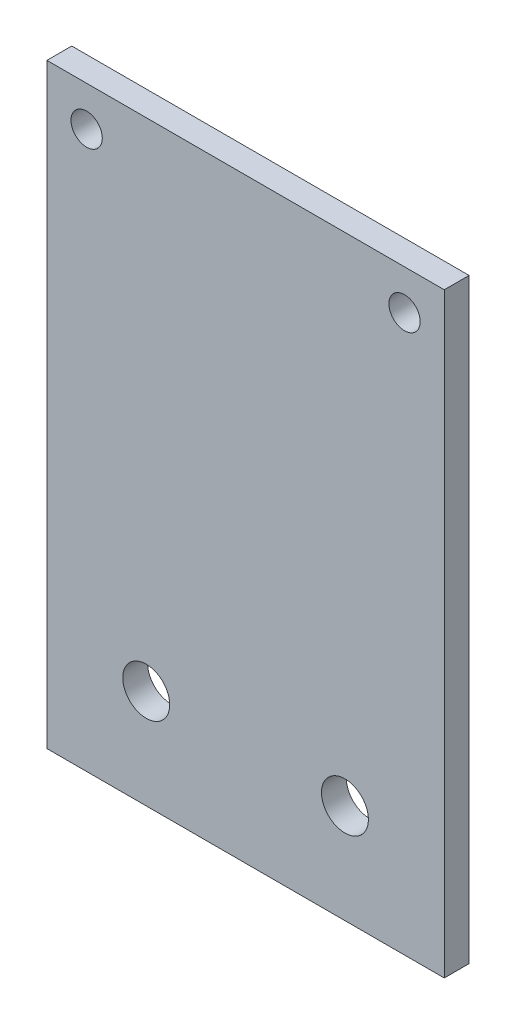
ISO-10303-21;
HEADER;
FILE_DESCRIPTION(('STEP AP214'),'2;1');
FILE_NAME('part.step','',(''),(''),'','','');
FILE_SCHEMA(('AUTOMOTIVE_DESIGN { 1 0 10303 214 1 1 1 1 }'));
ENDSEC;
DATA;
#1=APPLICATION_CONTEXT('core data for automotive mechanical design processes');
#2=APPLICATION_PROTOCOL_DEFINITION('international standard','automotive_design',2000,#1);
#3=PRODUCT_CONTEXT('',#1,'mechanical');
#4=PRODUCT('Part','Part','',(#3));
#5=PRODUCT_RELATED_PRODUCT_CATEGORY('part','',(#4));
#6=PRODUCT_DEFINITION_FORMATION('','',#4);
#7=PRODUCT_DEFINITION_CONTEXT('part definition',#1,'design');
#8=PRODUCT_DEFINITION('design','',#6,#7);
#9=PRODUCT_DEFINITION_SHAPE('','',#8);
#10=(LENGTH_UNIT() NAMED_UNIT(*) SI_UNIT(.MILLI.,.METRE.));
#11=(NAMED_UNIT(*) PLANE_ANGLE_UNIT() SI_UNIT($,.RADIAN.));
#12=(NAMED_UNIT(*) SI_UNIT($,.STERADIAN.) SOLID_ANGLE_UNIT());
#13=UNCERTAINTY_MEASURE_WITH_UNIT(LENGTH_MEASURE(1.E-05),#10,'distance_accuracy_value','');
#14=(GEOMETRIC_REPRESENTATION_CONTEXT(3) GLOBAL_UNCERTAINTY_ASSIGNED_CONTEXT((#13)) GLOBAL_UNIT_ASSIGNED_CONTEXT((#10,
#11,#12)) REPRESENTATION_CONTEXT('',''));
#15=CARTESIAN_POINT('',(0.,0.,0.));
#16=DIRECTION('',(0.,0.,1.));
#17=DIRECTION('',(1.,0.,0.));
#18=AXIS2_PLACEMENT_3D('',#15,#16,#17);
#19=CARTESIAN_POINT('',(0.,0.,3.175));
#20=DIRECTION('',(1.,0.,0.));
#21=DIRECTION('',(0.,1.,0.));
#22=AXIS2_PLACEMENT_3D('',#19,#20,#21);
#23=PLANE('',#22);
#24=DIRECTION('',(0.,-1.,0.));
#25=VECTOR('',#24,1.);
#26=CARTESIAN_POINT('',(0.,0.,0.));
#27=LINE('',#26,#25);
#28=CARTESIAN_POINT('',(0.,76.2,0.));
#29=VERTEX_POINT('',#28);
#30=CARTESIAN_POINT('',(0.,0.,0.));
#31=VERTEX_POINT('',#30);
#32=EDGE_CURVE('E94',#29,#31,#27,.T.);
#33=ORIENTED_EDGE('',*,*,#32,.T.);
#34=DIRECTION('',(0.,0.,-1.));
#35=VECTOR('',#34,1.);
#36=CARTESIAN_POINT('',(0.,0.,3.175));
#37=LINE('',#36,#35);
#38=CARTESIAN_POINT('',(0.,0.,3.175));
#39=VERTEX_POINT('',#38);
#40=EDGE_CURVE('E11',#39,#31,#37,.T.);
#41=ORIENTED_EDGE('',*,*,#40,.F.);
#42=DIRECTION('',(0.,-1.,0.));
#43=VECTOR('',#42,1.);
#44=CARTESIAN_POINT('',(0.,0.,3.175));
#45=LINE('',#44,#43);
#46=CARTESIAN_POINT('',(0.,76.2,3.175));
#47=VERTEX_POINT('',#46);
#48=EDGE_CURVE('E82',#47,#39,#45,.T.);
#49=ORIENTED_EDGE('',*,*,#48,.F.);
#50=DIRECTION('',(0.,0.,-1.));
#51=VECTOR('',#50,1.);
#52=CARTESIAN_POINT('',(0.,76.2,3.175));
#53=LINE('',#52,#51);
#54=EDGE_CURVE('E90',#47,#29,#53,.T.);
#55=ORIENTED_EDGE('',*,*,#54,.T.);
#56=EDGE_LOOP('',(#33,#41,#49,#55));
#57=FACE_BOUND('',#56,.T.);
#58=ADVANCED_FACE('F31',(#57),#23,.F.);
#59=CARTESIAN_POINT('',(0.,0.,3.175));
#60=DIRECTION('',(0.,1.,0.));
#61=DIRECTION('',(0.,0.,1.));
#62=AXIS2_PLACEMENT_3D('',#59,#60,#61);
#63=PLANE('',#62);
#64=DIRECTION('',(1.,0.,0.));
#65=VECTOR('',#64,1.);
#66=CARTESIAN_POINT('',(0.,0.,0.));
#67=LINE('',#66,#65);
#68=CARTESIAN_POINT('',(50.8,0.,0.));
#69=VERTEX_POINT('',#68);
#70=EDGE_CURVE('E86',#31,#69,#67,.T.);
#71=ORIENTED_EDGE('',*,*,#70,.T.);
#72=DIRECTION('',(0.,0.,-1.));
#73=VECTOR('',#72,1.);
#74=CARTESIAN_POINT('',(50.8,0.,3.175));
#75=LINE('',#74,#73);
#76=CARTESIAN_POINT('',(50.8,0.,3.175));
#77=VERTEX_POINT('',#76);
#78=EDGE_CURVE('E39',#77,#69,#75,.T.);
#79=ORIENTED_EDGE('',*,*,#78,.F.);
#80=DIRECTION('',(1.,0.,0.));
#81=VECTOR('',#80,1.);
#82=CARTESIAN_POINT('',(0.,0.,3.175));
#83=LINE('',#82,#81);
#84=EDGE_CURVE('E77',#39,#77,#83,.T.);
#85=ORIENTED_EDGE('',*,*,#84,.F.);
#86=ORIENTED_EDGE('',*,*,#40,.T.);
#87=EDGE_LOOP('',(#71,#79,#85,#86));
#88=FACE_BOUND('',#87,.T.);
#89=ADVANCED_FACE('F85',(#88),#63,.F.);
#90=CARTESIAN_POINT('',(50.8,0.,3.175));
#91=DIRECTION('',(-1.,0.,0.));
#92=DIRECTION('',(0.,-1.,0.));
#93=AXIS2_PLACEMENT_3D('',#90,#91,#92);
#94=PLANE('',#93);
#95=DIRECTION('',(0.,1.,0.));
#96=VECTOR('',#95,1.);
#97=CARTESIAN_POINT('',(50.8,0.,0.));
#98=LINE('',#97,#96);
#99=CARTESIAN_POINT('',(50.8,76.2,0.));
#100=VERTEX_POINT('',#99);
#101=EDGE_CURVE('E64',#69,#100,#98,.T.);
#102=ORIENTED_EDGE('',*,*,#101,.T.);
#103=DIRECTION('',(0.,0.,-1.));
#104=VECTOR('',#103,1.);
#105=CARTESIAN_POINT('',(50.8,76.2,3.175));
#106=LINE('',#105,#104);
#107=CARTESIAN_POINT('',(50.8,76.2,3.175));
#108=VERTEX_POINT('',#107);
#109=EDGE_CURVE('E87',#108,#100,#106,.T.);
#110=ORIENTED_EDGE('',*,*,#109,.F.);
#111=DIRECTION('',(0.,1.,0.));
#112=VECTOR('',#111,1.);
#113=CARTESIAN_POINT('',(50.8,0.,3.175));
#114=LINE('',#113,#112);
#115=EDGE_CURVE('E80',#77,#108,#114,.T.);
#116=ORIENTED_EDGE('',*,*,#115,.F.);
#117=ORIENTED_EDGE('',*,*,#78,.T.);
#118=EDGE_LOOP('',(#102,#110,#116,#117));
#119=FACE_BOUND('',#118,.T.);
#120=ADVANCED_FACE('F88',(#119),#94,.F.);
#121=CARTESIAN_POINT('',(0.,76.2,3.175));
#122=DIRECTION('',(0.,-1.,0.));
#123=DIRECTION('',(0.,0.,-1.));
#124=AXIS2_PLACEMENT_3D('',#121,#122,#123);
#125=PLANE('',#124);
#126=DIRECTION('',(-1.,0.,0.));
#127=VECTOR('',#126,1.);
#128=CARTESIAN_POINT('',(0.,76.2,0.));
#129=LINE('',#128,#127);
#130=EDGE_CURVE('E70',#100,#29,#129,.T.);
#131=ORIENTED_EDGE('',*,*,#130,.T.);
#132=ORIENTED_EDGE('',*,*,#54,.F.);
#133=DIRECTION('',(-1.,0.,0.));
#134=VECTOR('',#133,1.);
#135=CARTESIAN_POINT('',(0.,76.2,3.175));
#136=LINE('',#135,#134);
#137=EDGE_CURVE('E47',#108,#47,#136,.T.);
#138=ORIENTED_EDGE('',*,*,#137,.F.);
#139=ORIENTED_EDGE('',*,*,#109,.T.);
#140=EDGE_LOOP('',(#131,#132,#138,#139));
#141=FACE_BOUND('',#140,.T.);
#142=ADVANCED_FACE('F102',(#141),#125,.F.);
#143=CARTESIAN_POINT('',(0.,76.2,3.175));
#144=DIRECTION('',(0.,0.,-1.));
#145=DIRECTION('',(-1.,0.,0.));
#146=AXIS2_PLACEMENT_3D('',#143,#144,#145);
#147=PLANE('',#146);
#148=CARTESIAN_POINT('',(38.1,12.7,3.175));
#149=DIRECTION('',(0.,0.,1.));
#150=DIRECTION('',(1.,0.,0.));
#151=AXIS2_PLACEMENT_3D('',#148,#149,#150);
#152=CIRCLE('',#151,3.);
#153=CARTESIAN_POINT('',(41.1,12.7,3.175));
#154=VERTEX_POINT('',#153);
#155=EDGE_CURVE('E126',#154,#154,#152,.T.);
#156=ORIENTED_EDGE('',*,*,#155,.F.);
#157=EDGE_LOOP('',(#156));
#158=FACE_BOUND('',#157,.T.);
#159=CARTESIAN_POINT('',(12.7,12.7,3.175));
#160=DIRECTION('',(0.,0.,1.));
#161=DIRECTION('',(1.,0.,0.));
#162=AXIS2_PLACEMENT_3D('',#159,#160,#161);
#163=CIRCLE('',#162,3.);
#164=CARTESIAN_POINT('',(15.7,12.7,3.175));
#165=VERTEX_POINT('',#164);
#166=EDGE_CURVE('E120',#165,#165,#163,.T.);
#167=ORIENTED_EDGE('',*,*,#166,.F.);
#168=EDGE_LOOP('',(#167));
#169=FACE_BOUND('',#168,.T.);
#170=CARTESIAN_POINT('',(45.72,71.12,3.175));
#171=DIRECTION('',(0.,0.,1.));
#172=DIRECTION('',(1.,0.,0.));
#173=AXIS2_PLACEMENT_3D('',#170,#171,#172);
#174=CIRCLE('',#173,2.);
#175=CARTESIAN_POINT('',(47.72,71.12,3.175));
#176=VERTEX_POINT('',#175);
#177=EDGE_CURVE('E114',#176,#176,#174,.T.);
#178=ORIENTED_EDGE('',*,*,#177,.F.);
#179=EDGE_LOOP('',(#178));
#180=FACE_BOUND('',#179,.T.);
#181=CARTESIAN_POINT('',(5.07999999999998,71.12,3.175));
#182=DIRECTION('',(0.,0.,1.));
#183=DIRECTION('',(1.,0.,0.));
#184=AXIS2_PLACEMENT_3D('',#181,#182,#183);
#185=CIRCLE('',#184,2.);
#186=CARTESIAN_POINT('',(7.07999999999998,71.12,3.175));
#187=VERTEX_POINT('',#186);
#188=EDGE_CURVE('E108',#187,#187,#185,.T.);
#189=ORIENTED_EDGE('',*,*,#188,.F.);
#190=EDGE_LOOP('',(#189));
#191=FACE_BOUND('',#190,.T.);
#192=ORIENTED_EDGE('',*,*,#48,.T.);
#193=ORIENTED_EDGE('',*,*,#84,.T.);
#194=ORIENTED_EDGE('',*,*,#115,.T.);
#195=ORIENTED_EDGE('',*,*,#137,.T.);
#196=EDGE_LOOP('',(#192,#193,#194,#195));
#197=FACE_BOUND('',#196,.T.);
#198=ADVANCED_FACE('F78',(#158,#169,#180,#191,#197),#147,.F.);
#199=CARTESIAN_POINT('',(0.,76.2,0.));
#200=DIRECTION('',(0.,0.,-1.));
#201=DIRECTION('',(-1.,0.,0.));
#202=AXIS2_PLACEMENT_3D('',#199,#200,#201);
#203=PLANE('',#202);
#204=CARTESIAN_POINT('',(38.1,12.7,0.));
#205=DIRECTION('',(0.,0.,1.));
#206=DIRECTION('',(1.,0.,0.));
#207=AXIS2_PLACEMENT_3D('',#204,#205,#206);
#208=CIRCLE('',#207,3.);
#209=CARTESIAN_POINT('',(41.1,12.7,0.));
#210=VERTEX_POINT('',#209);
#211=EDGE_CURVE('E123',#210,#210,#208,.T.);
#212=ORIENTED_EDGE('',*,*,#211,.T.);
#213=EDGE_LOOP('',(#212));
#214=FACE_BOUND('',#213,.T.);
#215=CARTESIAN_POINT('',(12.7,12.7,0.));
#216=DIRECTION('',(0.,0.,1.));
#217=DIRECTION('',(1.,0.,0.));
#218=AXIS2_PLACEMENT_3D('',#215,#216,#217);
#219=CIRCLE('',#218,3.);
#220=CARTESIAN_POINT('',(15.7,12.7,0.));
#221=VERTEX_POINT('',#220);
#222=EDGE_CURVE('E117',#221,#221,#219,.T.);
#223=ORIENTED_EDGE('',*,*,#222,.T.);
#224=EDGE_LOOP('',(#223));
#225=FACE_BOUND('',#224,.T.);
#226=CARTESIAN_POINT('',(45.72,71.12,0.));
#227=DIRECTION('',(0.,0.,1.));
#228=DIRECTION('',(1.,0.,0.));
#229=AXIS2_PLACEMENT_3D('',#226,#227,#228);
#230=CIRCLE('',#229,2.);
#231=CARTESIAN_POINT('',(47.72,71.12,0.));
#232=VERTEX_POINT('',#231);
#233=EDGE_CURVE('E111',#232,#232,#230,.T.);
#234=ORIENTED_EDGE('',*,*,#233,.T.);
#235=EDGE_LOOP('',(#234));
#236=FACE_BOUND('',#235,.T.);
#237=CARTESIAN_POINT('',(5.07999999999998,71.12,0.));
#238=DIRECTION('',(0.,0.,1.));
#239=DIRECTION('',(1.,0.,0.));
#240=AXIS2_PLACEMENT_3D('',#237,#238,#239);
#241=CIRCLE('',#240,2.);
#242=CARTESIAN_POINT('',(7.07999999999998,71.12,0.));
#243=VERTEX_POINT('',#242);
#244=EDGE_CURVE('E97',#243,#243,#241,.T.);
#245=ORIENTED_EDGE('',*,*,#244,.T.);
#246=EDGE_LOOP('',(#245));
#247=FACE_BOUND('',#246,.T.);
#248=ORIENTED_EDGE('',*,*,#32,.F.);
#249=ORIENTED_EDGE('',*,*,#130,.F.);
#250=ORIENTED_EDGE('',*,*,#101,.F.);
#251=ORIENTED_EDGE('',*,*,#70,.F.);
#252=EDGE_LOOP('',(#248,#249,#250,#251));
#253=FACE_BOUND('',#252,.T.);
#254=ADVANCED_FACE('F105',(#214,#225,#236,#247,#253),#203,.T.);
#255=CARTESIAN_POINT('',(5.07999999999998,71.12,0.));
#256=DIRECTION('',(0.,0.,1.));
#257=DIRECTION('',(1.,0.,0.));
#258=AXIS2_PLACEMENT_3D('',#255,#256,#257);
#259=CYLINDRICAL_SURFACE('',#258,2.);
#260=ORIENTED_EDGE('',*,*,#244,.F.);
#261=EDGE_LOOP('',(#260));
#262=FACE_BOUND('',#261,.T.);
#263=ORIENTED_EDGE('',*,*,#188,.T.);
#264=EDGE_LOOP('',(#263));
#265=FACE_BOUND('',#264,.T.);
#266=ADVANCED_FACE('F150',(#262,#265),#259,.F.);
#267=CARTESIAN_POINT('',(45.72,71.12,0.));
#268=DIRECTION('',(0.,0.,1.));
#269=DIRECTION('',(1.,0.,0.));
#270=AXIS2_PLACEMENT_3D('',#267,#268,#269);
#271=CYLINDRICAL_SURFACE('',#270,2.);
#272=ORIENTED_EDGE('',*,*,#233,.F.);
#273=EDGE_LOOP('',(#272));
#274=FACE_BOUND('',#273,.T.);
#275=ORIENTED_EDGE('',*,*,#177,.T.);
#276=EDGE_LOOP('',(#275));
#277=FACE_BOUND('',#276,.T.);
#278=ADVANCED_FACE('F152',(#274,#277),#271,.F.);
#279=CARTESIAN_POINT('',(12.7,12.7,0.));
#280=DIRECTION('',(0.,0.,1.));
#281=DIRECTION('',(1.,0.,0.));
#282=AXIS2_PLACEMENT_3D('',#279,#280,#281);
#283=CYLINDRICAL_SURFACE('',#282,3.);
#284=ORIENTED_EDGE('',*,*,#222,.F.);
#285=EDGE_LOOP('',(#284));
#286=FACE_BOUND('',#285,.T.);
#287=ORIENTED_EDGE('',*,*,#166,.T.);
#288=EDGE_LOOP('',(#287));
#289=FACE_BOUND('',#288,.T.);
#290=ADVANCED_FACE('F137',(#286,#289),#283,.F.);
#291=CARTESIAN_POINT('',(38.1,12.7,0.));
#292=DIRECTION('',(0.,0.,1.));
#293=DIRECTION('',(1.,0.,0.));
#294=AXIS2_PLACEMENT_3D('',#291,#292,#293);
#295=CYLINDRICAL_SURFACE('',#294,3.);
#296=ORIENTED_EDGE('',*,*,#211,.F.);
#297=EDGE_LOOP('',(#296));
#298=FACE_BOUND('',#297,.T.);
#299=ORIENTED_EDGE('',*,*,#155,.T.);
#300=EDGE_LOOP('',(#299));
#301=FACE_BOUND('',#300,.T.);
#302=ADVANCED_FACE('F134',(#298,#301),#295,.F.);
#303=CLOSED_SHELL('',(#58,#89,#120,#142,#198,#254,#266,#278,#290,#302));
#304=MANIFOLD_SOLID_BREP('B2',#303);
#305=ADVANCED_BREP_SHAPE_REPRESENTATION('',(#18,#304),#14);
#306=SHAPE_DEFINITION_REPRESENTATION(#9,#305);
ENDSEC;
END-ISO-10303-21;
